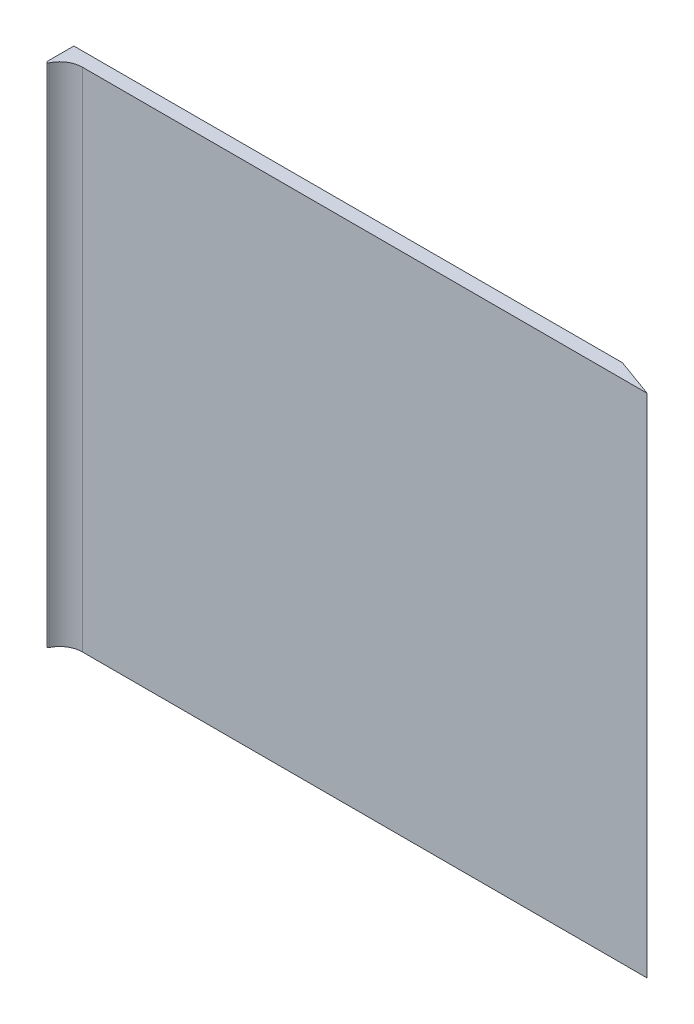
ISO-10303-21;
HEADER;
FILE_DESCRIPTION(('STEP AP214'),'2;1');
FILE_NAME('part.step','',(''),(''),'','','');
FILE_SCHEMA(('AUTOMOTIVE_DESIGN { 1 0 10303 214 1 1 1 1 }'));
ENDSEC;
DATA;
#1=APPLICATION_CONTEXT('core data for automotive mechanical design processes');
#2=APPLICATION_PROTOCOL_DEFINITION('international standard','automotive_design',2000,#1);
#3=PRODUCT_CONTEXT('',#1,'mechanical');
#4=PRODUCT('Part','Part','',(#3));
#5=PRODUCT_RELATED_PRODUCT_CATEGORY('part','',(#4));
#6=PRODUCT_DEFINITION_FORMATION('','',#4);
#7=PRODUCT_DEFINITION_CONTEXT('part definition',#1,'design');
#8=PRODUCT_DEFINITION('design','',#6,#7);
#9=PRODUCT_DEFINITION_SHAPE('','',#8);
#10=(LENGTH_UNIT() NAMED_UNIT(*) SI_UNIT(.MILLI.,.METRE.));
#11=(NAMED_UNIT(*) PLANE_ANGLE_UNIT() SI_UNIT($,.RADIAN.));
#12=(NAMED_UNIT(*) SI_UNIT($,.STERADIAN.) SOLID_ANGLE_UNIT());
#13=UNCERTAINTY_MEASURE_WITH_UNIT(LENGTH_MEASURE(1.E-05),#10,'distance_accuracy_value','');
#14=(GEOMETRIC_REPRESENTATION_CONTEXT(3) GLOBAL_UNCERTAINTY_ASSIGNED_CONTEXT((#13)) GLOBAL_UNIT_ASSIGNED_CONTEXT((#10,
#11,#12)) REPRESENTATION_CONTEXT('',''));
#15=CARTESIAN_POINT('',(0.,0.,0.));
#16=DIRECTION('',(0.,0.,1.));
#17=DIRECTION('',(1.,0.,0.));
#18=AXIS2_PLACEMENT_3D('',#15,#16,#17);
#19=CARTESIAN_POINT('',(-97.5,90.,2.5));
#20=DIRECTION('',(1.,0.,0.));
#21=DIRECTION('',(0.,0.,-1.));
#22=AXIS2_PLACEMENT_3D('',#19,#20,#21);
#23=PLANE('',#22);
#24=DIRECTION('',(0.,0.,-1.));
#25=VECTOR('',#24,1.);
#26=CARTESIAN_POINT('',(-97.5,-90.,2.5));
#27=LINE('',#26,#25);
#28=CARTESIAN_POINT('',(-97.5,-90.,6.92229123600031));
#29=VERTEX_POINT('',#28);
#30=CARTESIAN_POINT('',(-97.5,-90.,-2.5));
#31=VERTEX_POINT('',#30);
#32=EDGE_CURVE('E105',#29,#31,#27,.T.);
#33=ORIENTED_EDGE('',*,*,#32,.F.);
#34=DIRECTION('',(0.,1.,0.));
#35=VECTOR('',#34,1.);
#36=CARTESIAN_POINT('',(-97.5,90.,6.92229123600031));
#37=LINE('',#36,#35);
#38=CARTESIAN_POINT('',(-97.5,90.,6.92229123600031));
#39=VERTEX_POINT('',#38);
#40=EDGE_CURVE('E45',#29,#39,#37,.T.);
#41=ORIENTED_EDGE('',*,*,#40,.T.);
#42=DIRECTION('',(0.,0.,-1.));
#43=VECTOR('',#42,1.);
#44=CARTESIAN_POINT('',(-97.5,90.,2.5));
#45=LINE('',#44,#43);
#46=CARTESIAN_POINT('',(-97.5,90.,-2.5));
#47=VERTEX_POINT('',#46);
#48=EDGE_CURVE('E128',#39,#47,#45,.T.);
#49=ORIENTED_EDGE('',*,*,#48,.T.);
#50=DIRECTION('',(0.,-1.,0.));
#51=VECTOR('',#50,1.);
#52=CARTESIAN_POINT('',(-97.5,90.,-2.5));
#53=LINE('',#52,#51);
#54=EDGE_CURVE('E106',#47,#31,#53,.T.);
#55=ORIENTED_EDGE('',*,*,#54,.T.);
#56=EDGE_LOOP('',(#33,#41,#49,#55));
#57=FACE_BOUND('',#56,.T.);
#58=ADVANCED_FACE('F37',(#57),#23,.F.);
#59=CARTESIAN_POINT('',(-97.5,-90.,2.5));
#60=DIRECTION('',(0.,1.,0.));
#61=DIRECTION('',(-1.,0.,0.));
#62=AXIS2_PLACEMENT_3D('',#59,#60,#61);
#63=PLANE('',#62);
#64=CARTESIAN_POINT('',(-89.5,-90.,10.5));
#65=DIRECTION('',(0.,1.,0.));
#66=DIRECTION('',(-1.,0.,0.));
#67=AXIS2_PLACEMENT_3D('',#64,#65,#66);
#68=CIRCLE('',#67,8.);
#69=CARTESIAN_POINT('',(-89.5,-90.,2.5));
#70=VERTEX_POINT('',#69);
#71=CARTESIAN_POINT('',(-96.7380952380953,-90.,7.09265832000029));
#72=VERTEX_POINT('',#71);
#73=EDGE_CURVE('E117',#70,#72,#68,.T.);
#74=ORIENTED_EDGE('',*,*,#73,.T.);
#75=CARTESIAN_POINT('',(-97.1,-90.,6.92229123600031));
#76=DIRECTION('',(0.,1.,0.));
#77=DIRECTION('',(-1.,0.,0.));
#78=AXIS2_PLACEMENT_3D('',#75,#76,#77);
#79=CIRCLE('',#78,0.4);
#80=EDGE_CURVE('E59',#72,#29,#79,.F.);
#81=ORIENTED_EDGE('',*,*,#80,.T.);
#82=ORIENTED_EDGE('',*,*,#32,.T.);
#83=DIRECTION('',(1.,0.,0.));
#84=VECTOR('',#83,1.);
#85=CARTESIAN_POINT('',(-97.5,-90.,-2.5));
#86=LINE('',#85,#84);
#87=CARTESIAN_POINT('',(97.5,-90.,-2.5));
#88=VERTEX_POINT('',#87);
#89=EDGE_CURVE('E92',#31,#88,#86,.T.);
#90=ORIENTED_EDGE('',*,*,#89,.T.);
#91=DIRECTION('',(0.939692620785908,0.,0.34202014332567));
#92=VECTOR('',#91,1.);
#93=CARTESIAN_POINT('',(97.5,-90.,-2.5));
#94=LINE('',#93,#92);
#95=CARTESIAN_POINT('',(111.237387097273,-90.,2.5));
#96=VERTEX_POINT('',#95);
#97=EDGE_CURVE('E104',#88,#96,#94,.T.);
#98=ORIENTED_EDGE('',*,*,#97,.T.);
#99=DIRECTION('',(1.,0.,0.));
#100=VECTOR('',#99,1.);
#101=CARTESIAN_POINT('',(-97.5,-90.,2.5));
#102=LINE('',#101,#100);
#103=EDGE_CURVE('E123',#70,#96,#102,.T.);
#104=ORIENTED_EDGE('',*,*,#103,.F.);
#105=EDGE_LOOP('',(#74,#81,#82,#90,#98,#104));
#106=FACE_BOUND('',#105,.T.);
#107=ADVANCED_FACE('F102',(#106),#63,.F.);
#108=CARTESIAN_POINT('',(-97.5,90.,2.5));
#109=DIRECTION('',(0.,-1.,0.));
#110=DIRECTION('',(1.,0.,0.));
#111=AXIS2_PLACEMENT_3D('',#108,#109,#110);
#112=PLANE('',#111);
#113=ORIENTED_EDGE('',*,*,#48,.F.);
#114=CARTESIAN_POINT('',(-97.1,90.,6.92229123600031));
#115=DIRECTION('',(0.,-1.,0.));
#116=DIRECTION('',(1.,0.,0.));
#117=AXIS2_PLACEMENT_3D('',#114,#115,#116);
#118=CIRCLE('',#117,0.4);
#119=CARTESIAN_POINT('',(-96.7380952380953,90.,7.09265832000029));
#120=VERTEX_POINT('',#119);
#121=EDGE_CURVE('E11',#39,#120,#118,.F.);
#122=ORIENTED_EDGE('',*,*,#121,.T.);
#123=CARTESIAN_POINT('',(-89.5,90.,10.5));
#124=DIRECTION('',(0.,-1.,0.));
#125=DIRECTION('',(1.,0.,0.));
#126=AXIS2_PLACEMENT_3D('',#123,#124,#125);
#127=CIRCLE('',#126,8.);
#128=CARTESIAN_POINT('',(-89.5,90.,2.5));
#129=VERTEX_POINT('',#128);
#130=EDGE_CURVE('E121',#120,#129,#127,.T.);
#131=ORIENTED_EDGE('',*,*,#130,.T.);
#132=DIRECTION('',(-1.,0.,0.));
#133=VECTOR('',#132,1.);
#134=CARTESIAN_POINT('',(-97.5,90.,2.5));
#135=LINE('',#134,#133);
#136=CARTESIAN_POINT('',(111.237387097273,90.,2.50000000000001));
#137=VERTEX_POINT('',#136);
#138=EDGE_CURVE('E125',#137,#129,#135,.T.);
#139=ORIENTED_EDGE('',*,*,#138,.F.);
#140=DIRECTION('',(-0.939692620785908,0.,-0.34202014332567));
#141=VECTOR('',#140,1.);
#142=CARTESIAN_POINT('',(97.5,90.,-2.5));
#143=LINE('',#142,#141);
#144=CARTESIAN_POINT('',(97.5,90.,-2.5));
#145=VERTEX_POINT('',#144);
#146=EDGE_CURVE('E113',#137,#145,#143,.T.);
#147=ORIENTED_EDGE('',*,*,#146,.T.);
#148=DIRECTION('',(-1.,0.,0.));
#149=VECTOR('',#148,1.);
#150=CARTESIAN_POINT('',(-97.5,90.,-2.5));
#151=LINE('',#150,#149);
#152=EDGE_CURVE('E95',#145,#47,#151,.T.);
#153=ORIENTED_EDGE('',*,*,#152,.T.);
#154=EDGE_LOOP('',(#113,#122,#131,#139,#147,#153));
#155=FACE_BOUND('',#154,.T.);
#156=ADVANCED_FACE('F147',(#155),#112,.F.);
#157=CARTESIAN_POINT('',(0.,0.,2.5));
#158=DIRECTION('',(0.,0.,1.));
#159=DIRECTION('',(1.,0.,0.));
#160=AXIS2_PLACEMENT_3D('',#157,#158,#159);
#161=PLANE('',#160);
#162=DIRECTION('',(0.,-1.,0.));
#163=VECTOR('',#162,1.);
#164=CARTESIAN_POINT('',(-89.5,101.313708498985,2.5));
#165=LINE('',#164,#163);
#166=EDGE_CURVE('E119',#129,#70,#165,.T.);
#167=ORIENTED_EDGE('',*,*,#166,.T.);
#168=ORIENTED_EDGE('',*,*,#103,.T.);
#169=DIRECTION('',(0.,-1.,0.));
#170=VECTOR('',#169,1.);
#171=CARTESIAN_POINT('',(111.237387097273,104.619022000815,2.5));
#172=LINE('',#171,#170);
#173=EDGE_CURVE('E111',#137,#96,#172,.T.);
#174=ORIENTED_EDGE('',*,*,#173,.F.);
#175=ORIENTED_EDGE('',*,*,#138,.T.);
#176=EDGE_LOOP('',(#167,#168,#174,#175));
#177=FACE_BOUND('',#176,.T.);
#178=ADVANCED_FACE('F145',(#177),#161,.T.);
#179=CARTESIAN_POINT('',(0.,0.,-2.5));
#180=DIRECTION('',(0.,0.,1.));
#181=DIRECTION('',(1.,0.,0.));
#182=AXIS2_PLACEMENT_3D('',#179,#180,#181);
#183=PLANE('',#182);
#184=ORIENTED_EDGE('',*,*,#54,.F.);
#185=ORIENTED_EDGE('',*,*,#152,.F.);
#186=DIRECTION('',(0.,1.,0.));
#187=VECTOR('',#186,1.);
#188=CARTESIAN_POINT('',(97.5,90.,-2.5));
#189=LINE('',#188,#187);
#190=EDGE_CURVE('E88',#88,#145,#189,.T.);
#191=ORIENTED_EDGE('',*,*,#190,.F.);
#192=ORIENTED_EDGE('',*,*,#89,.F.);
#193=EDGE_LOOP('',(#184,#185,#191,#192));
#194=FACE_BOUND('',#193,.T.);
#195=ADVANCED_FACE('F91',(#194),#183,.F.);
#196=CARTESIAN_POINT('',(-89.5,101.313708498985,10.5));
#197=DIRECTION('',(0.,-1.,0.));
#198=DIRECTION('',(1.,0.,0.));
#199=AXIS2_PLACEMENT_3D('',#196,#197,#198);
#200=CYLINDRICAL_SURFACE('',#199,8.);
#201=ORIENTED_EDGE('',*,*,#130,.F.);
#202=DIRECTION('',(0.,-1.,0.));
#203=VECTOR('',#202,1.);
#204=CARTESIAN_POINT('',(-96.7380952380953,101.313708498985,7.09265832000029));
#205=LINE('',#204,#203);
#206=EDGE_CURVE('E133',#120,#72,#205,.T.);
#207=ORIENTED_EDGE('',*,*,#206,.T.);
#208=ORIENTED_EDGE('',*,*,#73,.F.);
#209=ORIENTED_EDGE('',*,*,#166,.F.);
#210=EDGE_LOOP('',(#201,#207,#208,#209));
#211=FACE_BOUND('',#210,.T.);
#212=ADVANCED_FACE('F140',(#211),#200,.F.);
#213=CARTESIAN_POINT('',(97.5,104.619022000815,-2.5));
#214=DIRECTION('',(0.34202014332567,0.,-0.939692620785908));
#215=DIRECTION('',(-0.939692620785908,0.,-0.34202014332567));
#216=AXIS2_PLACEMENT_3D('',#213,#214,#215);
#217=PLANE('',#216);
#218=ORIENTED_EDGE('',*,*,#146,.F.);
#219=ORIENTED_EDGE('',*,*,#173,.T.);
#220=ORIENTED_EDGE('',*,*,#97,.F.);
#221=ORIENTED_EDGE('',*,*,#190,.T.);
#222=EDGE_LOOP('',(#218,#219,#220,#221));
#223=FACE_BOUND('',#222,.T.);
#224=ADVANCED_FACE('F109',(#223),#217,.T.);
#225=CARTESIAN_POINT('',(-97.1,101.313708498985,6.92229123600031));
#226=DIRECTION('',(0.,-1.,0.));
#227=DIRECTION('',(1.,0.,0.));
#228=AXIS2_PLACEMENT_3D('',#225,#226,#227);
#229=CYLINDRICAL_SURFACE('',#228,0.4);
#230=ORIENTED_EDGE('',*,*,#121,.F.);
#231=ORIENTED_EDGE('',*,*,#40,.F.);
#232=ORIENTED_EDGE('',*,*,#80,.F.);
#233=ORIENTED_EDGE('',*,*,#206,.F.);
#234=EDGE_LOOP('',(#230,#231,#232,#233));
#235=FACE_BOUND('',#234,.T.);
#236=ADVANCED_FACE('F39',(#235),#229,.T.);
#237=CLOSED_SHELL('',(#58,#107,#156,#178,#195,#212,#224,#236));
#238=MANIFOLD_SOLID_BREP('B2',#237);
#239=ADVANCED_BREP_SHAPE_REPRESENTATION('',(#18,#238),#14);
#240=SHAPE_DEFINITION_REPRESENTATION(#9,#239);
ENDSEC;
END-ISO-10303-21;
